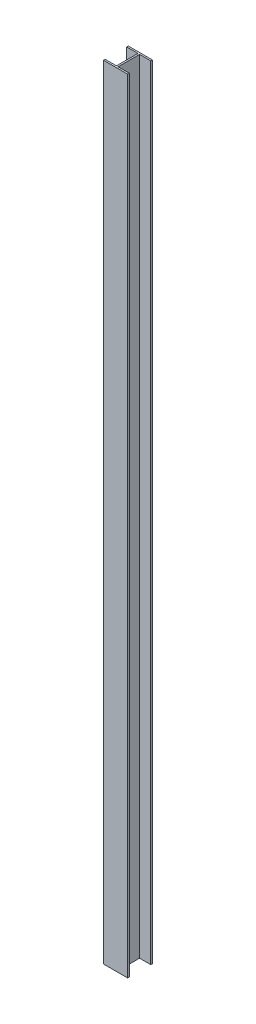
ISO-10303-21;
HEADER;
FILE_DESCRIPTION(('STEP AP214'),'2;1');
FILE_NAME('part.step','',(''),(''),'','','');
FILE_SCHEMA(('AUTOMOTIVE_DESIGN { 1 0 10303 214 1 1 1 1 }'));
ENDSEC;
DATA;
#1=APPLICATION_CONTEXT('core data for automotive mechanical design processes');
#2=APPLICATION_PROTOCOL_DEFINITION('international standard','automotive_design',2000,#1);
#3=PRODUCT_CONTEXT('',#1,'mechanical');
#4=PRODUCT('Part','Part','',(#3));
#5=PRODUCT_RELATED_PRODUCT_CATEGORY('part','',(#4));
#6=PRODUCT_DEFINITION_FORMATION('','',#4);
#7=PRODUCT_DEFINITION_CONTEXT('part definition',#1,'design');
#8=PRODUCT_DEFINITION('design','',#6,#7);
#9=PRODUCT_DEFINITION_SHAPE('','',#8);
#10=(LENGTH_UNIT() NAMED_UNIT(*) SI_UNIT(.MILLI.,.METRE.));
#11=(NAMED_UNIT(*) PLANE_ANGLE_UNIT() SI_UNIT($,.RADIAN.));
#12=(NAMED_UNIT(*) SI_UNIT($,.STERADIAN.) SOLID_ANGLE_UNIT());
#13=UNCERTAINTY_MEASURE_WITH_UNIT(LENGTH_MEASURE(1.E-05),#10,'distance_accuracy_value','');
#14=(GEOMETRIC_REPRESENTATION_CONTEXT(3) GLOBAL_UNCERTAINTY_ASSIGNED_CONTEXT((#13)) GLOBAL_UNIT_ASSIGNED_CONTEXT((#10,
#11,#12)) REPRESENTATION_CONTEXT('',''));
#15=CARTESIAN_POINT('',(0.,0.,0.));
#16=DIRECTION('',(0.,0.,1.));
#17=DIRECTION('',(1.,0.,0.));
#18=AXIS2_PLACEMENT_3D('',#15,#16,#17);
#19=CARTESIAN_POINT('',(51.5,3352.8,-70.8619705967856));
#20=DIRECTION('',(-1.,0.,0.));
#21=DIRECTION('',(0.,0.,1.));
#22=AXIS2_PLACEMENT_3D('',#19,#20,#21);
#23=PLANE('',#22);
#24=DIRECTION('',(0.,0.,-1.));
#25=VECTOR('',#24,1.);
#26=CARTESIAN_POINT('',(51.5,0.,-70.8619705967856));
#27=LINE('',#26,#25);
#28=CARTESIAN_POINT('',(51.5,0.,-63.7619705967856));
#29=VERTEX_POINT('',#28);
#30=CARTESIAN_POINT('',(51.5,0.,-70.8619705967856));
#31=VERTEX_POINT('',#30);
#32=EDGE_CURVE('E156',#29,#31,#27,.T.);
#33=ORIENTED_EDGE('',*,*,#32,.T.);
#34=DIRECTION('',(0.,-1.,0.));
#35=VECTOR('',#34,1.);
#36=CARTESIAN_POINT('',(51.5,3352.8,-70.8619705967856));
#37=LINE('',#36,#35);
#38=CARTESIAN_POINT('',(51.5,3352.8,-70.8619705967856));
#39=VERTEX_POINT('',#38);
#40=EDGE_CURVE('E11',#39,#31,#37,.T.);
#41=ORIENTED_EDGE('',*,*,#40,.F.);
#42=DIRECTION('',(0.,0.,-1.));
#43=VECTOR('',#42,1.);
#44=CARTESIAN_POINT('',(51.5,3352.8,-70.8619705967856));
#45=LINE('',#44,#43);
#46=CARTESIAN_POINT('',(51.5,3352.8,-63.7619705967856));
#47=VERTEX_POINT('',#46);
#48=EDGE_CURVE('E178',#47,#39,#45,.T.);
#49=ORIENTED_EDGE('',*,*,#48,.F.);
#50=DIRECTION('',(0.,-1.,0.));
#51=VECTOR('',#50,1.);
#52=CARTESIAN_POINT('',(51.5,3352.8,-63.7619705967856));
#53=LINE('',#52,#51);
#54=EDGE_CURVE('E152',#47,#29,#53,.T.);
#55=ORIENTED_EDGE('',*,*,#54,.T.);
#56=EDGE_LOOP('',(#33,#41,#49,#55));
#57=FACE_BOUND('',#56,.T.);
#58=ADVANCED_FACE('F36',(#57),#23,.F.);
#59=CARTESIAN_POINT('',(-51.5,3352.8,-70.8619705967856));
#60=DIRECTION('',(0.,0.,1.));
#61=DIRECTION('',(1.,0.,0.));
#62=AXIS2_PLACEMENT_3D('',#59,#60,#61);
#63=PLANE('',#62);
#64=DIRECTION('',(-1.,0.,0.));
#65=VECTOR('',#64,1.);
#66=CARTESIAN_POINT('',(-51.5,0.,-70.8619705967856));
#67=LINE('',#66,#65);
#68=CARTESIAN_POINT('',(-51.5,0.,-70.8619705967856));
#69=VERTEX_POINT('',#68);
#70=EDGE_CURVE('E159',#31,#69,#67,.T.);
#71=ORIENTED_EDGE('',*,*,#70,.T.);
#72=DIRECTION('',(0.,-1.,0.));
#73=VECTOR('',#72,1.);
#74=CARTESIAN_POINT('',(-51.5,3352.8,-70.8619705967856));
#75=LINE('',#74,#73);
#76=CARTESIAN_POINT('',(-51.5,3352.8,-70.8619705967856));
#77=VERTEX_POINT('',#76);
#78=EDGE_CURVE('E44',#77,#69,#75,.T.);
#79=ORIENTED_EDGE('',*,*,#78,.F.);
#80=DIRECTION('',(-1.,0.,0.));
#81=VECTOR('',#80,1.);
#82=CARTESIAN_POINT('',(-51.5,3352.8,-70.8619705967856));
#83=LINE('',#82,#81);
#84=EDGE_CURVE('E107',#39,#77,#83,.T.);
#85=ORIENTED_EDGE('',*,*,#84,.F.);
#86=ORIENTED_EDGE('',*,*,#40,.T.);
#87=EDGE_LOOP('',(#71,#79,#85,#86));
#88=FACE_BOUND('',#87,.T.);
#89=ADVANCED_FACE('F256',(#88),#63,.F.);
#90=CARTESIAN_POINT('',(-51.5,3352.8,-70.8619705967856));
#91=DIRECTION('',(1.,0.,0.));
#92=DIRECTION('',(0.,0.,-1.));
#93=AXIS2_PLACEMENT_3D('',#90,#91,#92);
#94=PLANE('',#93);
#95=DIRECTION('',(0.,0.,1.));
#96=VECTOR('',#95,1.);
#97=CARTESIAN_POINT('',(-51.5,0.,-70.8619705967856));
#98=LINE('',#97,#96);
#99=CARTESIAN_POINT('',(-51.5,0.,-63.7619705967856));
#100=VERTEX_POINT('',#99);
#101=EDGE_CURVE('E161',#69,#100,#98,.T.);
#102=ORIENTED_EDGE('',*,*,#101,.T.);
#103=DIRECTION('',(0.,-1.,0.));
#104=VECTOR('',#103,1.);
#105=CARTESIAN_POINT('',(-51.5,3352.8,-63.7619705967856));
#106=LINE('',#105,#104);
#107=CARTESIAN_POINT('',(-51.5,3352.8,-63.7619705967856));
#108=VERTEX_POINT('',#107);
#109=EDGE_CURVE('E197',#108,#100,#106,.T.);
#110=ORIENTED_EDGE('',*,*,#109,.F.);
#111=DIRECTION('',(0.,0.,1.));
#112=VECTOR('',#111,1.);
#113=CARTESIAN_POINT('',(-51.5,3352.8,-70.8619705967856));
#114=LINE('',#113,#112);
#115=EDGE_CURVE('E205',#77,#108,#114,.T.);
#116=ORIENTED_EDGE('',*,*,#115,.F.);
#117=ORIENTED_EDGE('',*,*,#78,.T.);
#118=EDGE_LOOP('',(#102,#110,#116,#117));
#119=FACE_BOUND('',#118,.T.);
#120=ADVANCED_FACE('F203',(#119),#94,.F.);
#121=CARTESIAN_POINT('',(-51.5,3352.8,-63.7619705967856));
#122=DIRECTION('',(0.,0.,-1.));
#123=DIRECTION('',(-1.,0.,0.));
#124=AXIS2_PLACEMENT_3D('',#121,#122,#123);
#125=PLANE('',#124);
#126=DIRECTION('',(1.,0.,0.));
#127=VECTOR('',#126,1.);
#128=CARTESIAN_POINT('',(-51.5,0.,-63.7619705967856));
#129=LINE('',#128,#127);
#130=CARTESIAN_POINT('',(-3.54999999999999,0.,-63.7619705967856));
#131=VERTEX_POINT('',#130);
#132=EDGE_CURVE('E163',#100,#131,#129,.T.);
#133=ORIENTED_EDGE('',*,*,#132,.T.);
#134=DIRECTION('',(0.,-1.,0.));
#135=VECTOR('',#134,1.);
#136=CARTESIAN_POINT('',(-3.54999999999999,3352.8,-63.7619705967856));
#137=LINE('',#136,#135);
#138=CARTESIAN_POINT('',(-3.54999999999999,3352.8,-63.7619705967856));
#139=VERTEX_POINT('',#138);
#140=EDGE_CURVE('E194',#139,#131,#137,.T.);
#141=ORIENTED_EDGE('',*,*,#140,.F.);
#142=DIRECTION('',(1.,0.,0.));
#143=VECTOR('',#142,1.);
#144=CARTESIAN_POINT('',(-51.5,3352.8,-63.7619705967856));
#145=LINE('',#144,#143);
#146=EDGE_CURVE('E223',#108,#139,#145,.T.);
#147=ORIENTED_EDGE('',*,*,#146,.F.);
#148=ORIENTED_EDGE('',*,*,#109,.T.);
#149=EDGE_LOOP('',(#133,#141,#147,#148));
#150=FACE_BOUND('',#149,.T.);
#151=ADVANCED_FACE('F214',(#150),#125,.F.);
#152=CARTESIAN_POINT('',(-3.54999999999999,3352.8,-63.7619705967856));
#153=DIRECTION('',(1.,0.,0.));
#154=DIRECTION('',(0.,0.,-1.));
#155=AXIS2_PLACEMENT_3D('',#152,#153,#154);
#156=PLANE('',#155);
#157=DIRECTION('',(0.,0.,1.));
#158=VECTOR('',#157,1.);
#159=CARTESIAN_POINT('',(-3.54999999999999,0.,-63.7619705967856));
#160=LINE('',#159,#158);
#161=CARTESIAN_POINT('',(-3.55,0.,28.0380294032144));
#162=VERTEX_POINT('',#161);
#163=EDGE_CURVE('E165',#131,#162,#160,.T.);
#164=ORIENTED_EDGE('',*,*,#163,.T.);
#165=DIRECTION('',(0.,-1.,0.));
#166=VECTOR('',#165,1.);
#167=CARTESIAN_POINT('',(-3.55,3352.8,28.0380294032144));
#168=LINE('',#167,#166);
#169=CARTESIAN_POINT('',(-3.55,3352.8,28.0380294032144));
#170=VERTEX_POINT('',#169);
#171=EDGE_CURVE('E191',#170,#162,#168,.T.);
#172=ORIENTED_EDGE('',*,*,#171,.F.);
#173=DIRECTION('',(0.,0.,1.));
#174=VECTOR('',#173,1.);
#175=CARTESIAN_POINT('',(-3.54999999999999,3352.8,-63.7619705967856));
#176=LINE('',#175,#174);
#177=EDGE_CURVE('E220',#139,#170,#176,.T.);
#178=ORIENTED_EDGE('',*,*,#177,.F.);
#179=ORIENTED_EDGE('',*,*,#140,.T.);
#180=EDGE_LOOP('',(#164,#172,#178,#179));
#181=FACE_BOUND('',#180,.T.);
#182=ADVANCED_FACE('F218',(#181),#156,.F.);
#183=CARTESIAN_POINT('',(-3.55,3352.8,28.0380294032144));
#184=DIRECTION('',(0.,0.,1.));
#185=DIRECTION('',(1.,0.,0.));
#186=AXIS2_PLACEMENT_3D('',#183,#184,#185);
#187=PLANE('',#186);
#188=DIRECTION('',(-1.,0.,0.));
#189=VECTOR('',#188,1.);
#190=CARTESIAN_POINT('',(-3.55,0.,28.0380294032144));
#191=LINE('',#190,#189);
#192=CARTESIAN_POINT('',(-51.5,0.,28.0380294032144));
#193=VERTEX_POINT('',#192);
#194=EDGE_CURVE('E167',#162,#193,#191,.T.);
#195=ORIENTED_EDGE('',*,*,#194,.T.);
#196=DIRECTION('',(0.,-1.,0.));
#197=VECTOR('',#196,1.);
#198=CARTESIAN_POINT('',(-51.5,3352.8,28.0380294032144));
#199=LINE('',#198,#197);
#200=CARTESIAN_POINT('',(-51.5,3352.8,28.0380294032144));
#201=VERTEX_POINT('',#200);
#202=EDGE_CURVE('E188',#201,#193,#199,.T.);
#203=ORIENTED_EDGE('',*,*,#202,.F.);
#204=DIRECTION('',(-1.,0.,0.));
#205=VECTOR('',#204,1.);
#206=CARTESIAN_POINT('',(-3.55,3352.8,28.0380294032144));
#207=LINE('',#206,#205);
#208=EDGE_CURVE('E222',#170,#201,#207,.T.);
#209=ORIENTED_EDGE('',*,*,#208,.F.);
#210=ORIENTED_EDGE('',*,*,#171,.T.);
#211=EDGE_LOOP('',(#195,#203,#209,#210));
#212=FACE_BOUND('',#211,.T.);
#213=ADVANCED_FACE('F269',(#212),#187,.F.);
#214=CARTESIAN_POINT('',(-51.5,3352.8,28.0380294032144));
#215=DIRECTION('',(1.,0.,0.));
#216=DIRECTION('',(0.,0.,-1.));
#217=AXIS2_PLACEMENT_3D('',#214,#215,#216);
#218=PLANE('',#217);
#219=DIRECTION('',(0.,0.,1.));
#220=VECTOR('',#219,1.);
#221=CARTESIAN_POINT('',(-51.5,0.,28.0380294032144));
#222=LINE('',#221,#220);
#223=CARTESIAN_POINT('',(-51.5,0.,35.1380294032144));
#224=VERTEX_POINT('',#223);
#225=EDGE_CURVE('E169',#193,#224,#222,.T.);
#226=ORIENTED_EDGE('',*,*,#225,.T.);
#227=DIRECTION('',(0.,-1.,0.));
#228=VECTOR('',#227,1.);
#229=CARTESIAN_POINT('',(-51.5,3352.8,35.1380294032144));
#230=LINE('',#229,#228);
#231=CARTESIAN_POINT('',(-51.5,3352.8,35.1380294032144));
#232=VERTEX_POINT('',#231);
#233=EDGE_CURVE('E185',#232,#224,#230,.T.);
#234=ORIENTED_EDGE('',*,*,#233,.F.);
#235=DIRECTION('',(0.,0.,1.));
#236=VECTOR('',#235,1.);
#237=CARTESIAN_POINT('',(-51.5,3352.8,28.0380294032144));
#238=LINE('',#237,#236);
#239=EDGE_CURVE('E225',#201,#232,#238,.T.);
#240=ORIENTED_EDGE('',*,*,#239,.F.);
#241=ORIENTED_EDGE('',*,*,#202,.T.);
#242=EDGE_LOOP('',(#226,#234,#240,#241));
#243=FACE_BOUND('',#242,.T.);
#244=ADVANCED_FACE('F272',(#243),#218,.F.);
#245=CARTESIAN_POINT('',(51.5,3352.8,35.1380294032144));
#246=DIRECTION('',(0.,0.,-1.));
#247=DIRECTION('',(-1.,0.,0.));
#248=AXIS2_PLACEMENT_3D('',#245,#246,#247);
#249=PLANE('',#248);
#250=DIRECTION('',(1.,0.,0.));
#251=VECTOR('',#250,1.);
#252=CARTESIAN_POINT('',(51.5,0.,35.1380294032144));
#253=LINE('',#252,#251);
#254=CARTESIAN_POINT('',(51.5,0.,35.1380294032144));
#255=VERTEX_POINT('',#254);
#256=EDGE_CURVE('E171',#224,#255,#253,.T.);
#257=ORIENTED_EDGE('',*,*,#256,.T.);
#258=DIRECTION('',(0.,-1.,0.));
#259=VECTOR('',#258,1.);
#260=CARTESIAN_POINT('',(51.5,3352.8,35.1380294032144));
#261=LINE('',#260,#259);
#262=CARTESIAN_POINT('',(51.5,3352.8,35.1380294032144));
#263=VERTEX_POINT('',#262);
#264=EDGE_CURVE('E182',#263,#255,#261,.T.);
#265=ORIENTED_EDGE('',*,*,#264,.F.);
#266=DIRECTION('',(1.,0.,0.));
#267=VECTOR('',#266,1.);
#268=CARTESIAN_POINT('',(51.5,3352.8,35.1380294032144));
#269=LINE('',#268,#267);
#270=EDGE_CURVE('E231',#232,#263,#269,.T.);
#271=ORIENTED_EDGE('',*,*,#270,.F.);
#272=ORIENTED_EDGE('',*,*,#233,.T.);
#273=EDGE_LOOP('',(#257,#265,#271,#272));
#274=FACE_BOUND('',#273,.T.);
#275=ADVANCED_FACE('F237',(#274),#249,.F.);
#276=CARTESIAN_POINT('',(51.5,3352.8,28.0380294032144));
#277=DIRECTION('',(-1.,0.,0.));
#278=DIRECTION('',(0.,0.,1.));
#279=AXIS2_PLACEMENT_3D('',#276,#277,#278);
#280=PLANE('',#279);
#281=DIRECTION('',(0.,0.,-1.));
#282=VECTOR('',#281,1.);
#283=CARTESIAN_POINT('',(51.5,0.,28.0380294032144));
#284=LINE('',#283,#282);
#285=CARTESIAN_POINT('',(51.5,0.,28.0380294032144));
#286=VERTEX_POINT('',#285);
#287=EDGE_CURVE('E173',#255,#286,#284,.T.);
#288=ORIENTED_EDGE('',*,*,#287,.T.);
#289=DIRECTION('',(0.,-1.,0.));
#290=VECTOR('',#289,1.);
#291=CARTESIAN_POINT('',(51.5,3352.8,28.0380294032144));
#292=LINE('',#291,#290);
#293=CARTESIAN_POINT('',(51.5,3352.8,28.0380294032144));
#294=VERTEX_POINT('',#293);
#295=EDGE_CURVE('E147',#294,#286,#292,.T.);
#296=ORIENTED_EDGE('',*,*,#295,.F.);
#297=DIRECTION('',(0.,0.,-1.));
#298=VECTOR('',#297,1.);
#299=CARTESIAN_POINT('',(51.5,3352.8,28.0380294032144));
#300=LINE('',#299,#298);
#301=EDGE_CURVE('E138',#263,#294,#300,.T.);
#302=ORIENTED_EDGE('',*,*,#301,.F.);
#303=ORIENTED_EDGE('',*,*,#264,.T.);
#304=EDGE_LOOP('',(#288,#296,#302,#303));
#305=FACE_BOUND('',#304,.T.);
#306=ADVANCED_FACE('F241',(#305),#280,.F.);
#307=CARTESIAN_POINT('',(3.55,3352.8,28.0380294032144));
#308=DIRECTION('',(0.,0.,1.));
#309=DIRECTION('',(1.,0.,0.));
#310=AXIS2_PLACEMENT_3D('',#307,#308,#309);
#311=PLANE('',#310);
#312=DIRECTION('',(-1.,0.,0.));
#313=VECTOR('',#312,1.);
#314=CARTESIAN_POINT('',(3.55,0.,28.0380294032144));
#315=LINE('',#314,#313);
#316=CARTESIAN_POINT('',(3.55,0.,28.0380294032144));
#317=VERTEX_POINT('',#316);
#318=EDGE_CURVE('E146',#286,#317,#315,.T.);
#319=ORIENTED_EDGE('',*,*,#318,.T.);
#320=DIRECTION('',(0.,-1.,0.));
#321=VECTOR('',#320,1.);
#322=CARTESIAN_POINT('',(3.55,3352.8,28.0380294032144));
#323=LINE('',#322,#321);
#324=CARTESIAN_POINT('',(3.55,3352.8,28.0380294032144));
#325=VERTEX_POINT('',#324);
#326=EDGE_CURVE('E143',#325,#317,#323,.T.);
#327=ORIENTED_EDGE('',*,*,#326,.F.);
#328=DIRECTION('',(-1.,0.,0.));
#329=VECTOR('',#328,1.);
#330=CARTESIAN_POINT('',(3.55,3352.8,28.0380294032144));
#331=LINE('',#330,#329);
#332=EDGE_CURVE('E132',#294,#325,#331,.T.);
#333=ORIENTED_EDGE('',*,*,#332,.F.);
#334=ORIENTED_EDGE('',*,*,#295,.T.);
#335=EDGE_LOOP('',(#319,#327,#333,#334));
#336=FACE_BOUND('',#335,.T.);
#337=ADVANCED_FACE('F144',(#336),#311,.F.);
#338=CARTESIAN_POINT('',(3.54999999999999,3352.8,-63.7619705967856));
#339=DIRECTION('',(-1.,0.,0.));
#340=DIRECTION('',(0.,0.,1.));
#341=AXIS2_PLACEMENT_3D('',#338,#339,#340);
#342=PLANE('',#341);
#343=DIRECTION('',(0.,0.,-1.));
#344=VECTOR('',#343,1.);
#345=CARTESIAN_POINT('',(3.54999999999999,0.,-63.7619705967856));
#346=LINE('',#345,#344);
#347=CARTESIAN_POINT('',(3.54999999999999,0.,-63.7619705967856));
#348=VERTEX_POINT('',#347);
#349=EDGE_CURVE('E93',#317,#348,#346,.T.);
#350=ORIENTED_EDGE('',*,*,#349,.T.);
#351=DIRECTION('',(0.,-1.,0.));
#352=VECTOR('',#351,1.);
#353=CARTESIAN_POINT('',(3.54999999999999,3352.8,-63.7619705967856));
#354=LINE('',#353,#352);
#355=CARTESIAN_POINT('',(3.54999999999999,3352.8,-63.7619705967856));
#356=VERTEX_POINT('',#355);
#357=EDGE_CURVE('E148',#356,#348,#354,.T.);
#358=ORIENTED_EDGE('',*,*,#357,.F.);
#359=DIRECTION('',(0.,0.,-1.));
#360=VECTOR('',#359,1.);
#361=CARTESIAN_POINT('',(3.54999999999999,3352.8,-63.7619705967856));
#362=LINE('',#361,#360);
#363=EDGE_CURVE('E136',#325,#356,#362,.T.);
#364=ORIENTED_EDGE('',*,*,#363,.F.);
#365=ORIENTED_EDGE('',*,*,#326,.T.);
#366=EDGE_LOOP('',(#350,#358,#364,#365));
#367=FACE_BOUND('',#366,.T.);
#368=ADVANCED_FACE('F150',(#367),#342,.F.);
#369=CARTESIAN_POINT('',(51.5,3352.8,-63.7619705967856));
#370=DIRECTION('',(0.,0.,-1.));
#371=DIRECTION('',(-1.,0.,0.));
#372=AXIS2_PLACEMENT_3D('',#369,#370,#371);
#373=PLANE('',#372);
#374=DIRECTION('',(1.,0.,0.));
#375=VECTOR('',#374,1.);
#376=CARTESIAN_POINT('',(51.5,0.,-63.7619705967856));
#377=LINE('',#376,#375);
#378=EDGE_CURVE('E99',#348,#29,#377,.T.);
#379=ORIENTED_EDGE('',*,*,#378,.T.);
#380=ORIENTED_EDGE('',*,*,#54,.F.);
#381=DIRECTION('',(1.,0.,0.));
#382=VECTOR('',#381,1.);
#383=CARTESIAN_POINT('',(51.5,3352.8,-63.7619705967856));
#384=LINE('',#383,#382);
#385=EDGE_CURVE('E52',#356,#47,#384,.T.);
#386=ORIENTED_EDGE('',*,*,#385,.F.);
#387=ORIENTED_EDGE('',*,*,#357,.T.);
#388=EDGE_LOOP('',(#379,#380,#386,#387));
#389=FACE_BOUND('',#388,.T.);
#390=ADVANCED_FACE('F245',(#389),#373,.F.);
#391=CARTESIAN_POINT('',(0.,3352.8,0.));
#392=DIRECTION('',(0.,-1.,0.));
#393=DIRECTION('',(0.,0.,-1.));
#394=AXIS2_PLACEMENT_3D('',#391,#392,#393);
#395=PLANE('',#394);
#396=ORIENTED_EDGE('',*,*,#48,.T.);
#397=ORIENTED_EDGE('',*,*,#84,.T.);
#398=ORIENTED_EDGE('',*,*,#115,.T.);
#399=ORIENTED_EDGE('',*,*,#146,.T.);
#400=ORIENTED_EDGE('',*,*,#177,.T.);
#401=ORIENTED_EDGE('',*,*,#208,.T.);
#402=ORIENTED_EDGE('',*,*,#239,.T.);
#403=ORIENTED_EDGE('',*,*,#270,.T.);
#404=ORIENTED_EDGE('',*,*,#301,.T.);
#405=ORIENTED_EDGE('',*,*,#332,.T.);
#406=ORIENTED_EDGE('',*,*,#363,.T.);
#407=ORIENTED_EDGE('',*,*,#385,.T.);
#408=EDGE_LOOP('',(#396,#397,#398,#399,#400,#401,#402,#403,#404,#405,#406,#407));
#409=FACE_BOUND('',#408,.T.);
#410=ADVANCED_FACE('F134',(#409),#395,.F.);
#411=CARTESIAN_POINT('',(0.,0.,0.));
#412=DIRECTION('',(0.,-1.,0.));
#413=DIRECTION('',(0.,0.,-1.));
#414=AXIS2_PLACEMENT_3D('',#411,#412,#413);
#415=PLANE('',#414);
#416=ORIENTED_EDGE('',*,*,#32,.F.);
#417=ORIENTED_EDGE('',*,*,#378,.F.);
#418=ORIENTED_EDGE('',*,*,#349,.F.);
#419=ORIENTED_EDGE('',*,*,#318,.F.);
#420=ORIENTED_EDGE('',*,*,#287,.F.);
#421=ORIENTED_EDGE('',*,*,#256,.F.);
#422=ORIENTED_EDGE('',*,*,#225,.F.);
#423=ORIENTED_EDGE('',*,*,#194,.F.);
#424=ORIENTED_EDGE('',*,*,#163,.F.);
#425=ORIENTED_EDGE('',*,*,#132,.F.);
#426=ORIENTED_EDGE('',*,*,#101,.F.);
#427=ORIENTED_EDGE('',*,*,#70,.F.);
#428=EDGE_LOOP('',(#416,#417,#418,#419,#420,#421,#422,#423,#424,#425,#426,#427));
#429=FACE_BOUND('',#428,.T.);
#430=ADVANCED_FACE('F209',(#429),#415,.T.);
#431=CLOSED_SHELL('',(#58,#89,#120,#151,#182,#213,#244,#275,#306,#337,#368,#390,#410,#430));
#432=MANIFOLD_SOLID_BREP('B2',#431);
#433=ADVANCED_BREP_SHAPE_REPRESENTATION('',(#18,#432),#14);
#434=SHAPE_DEFINITION_REPRESENTATION(#9,#433);
ENDSEC;
END-ISO-10303-21;
